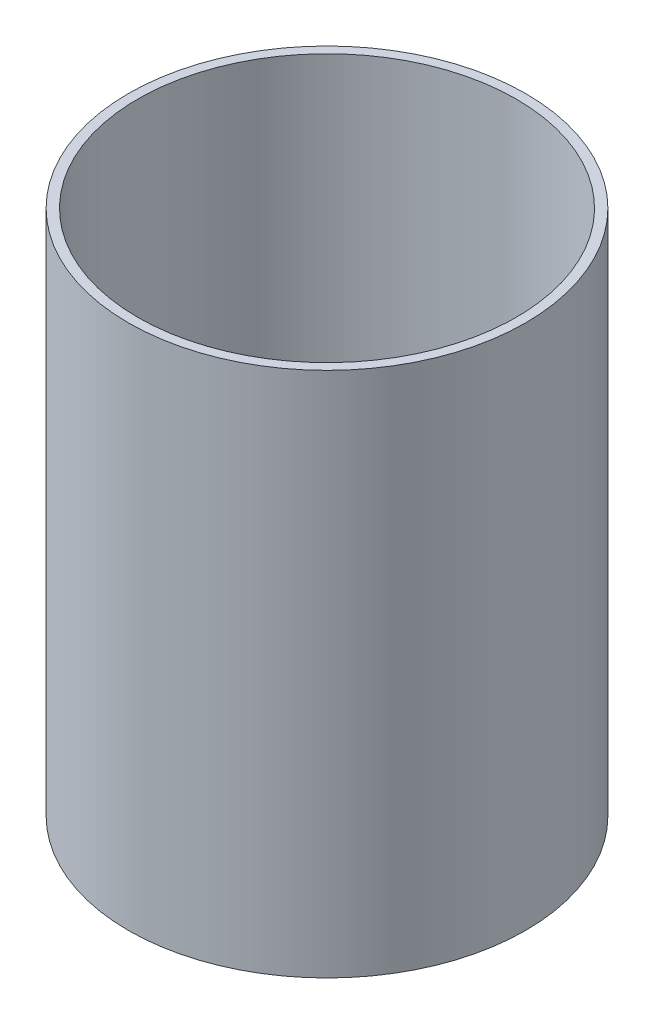
ISO-10303-21;
HEADER;
FILE_DESCRIPTION(('STEP AP214'),'2;1');
FILE_NAME('part.step','',(''),(''),'','','');
FILE_SCHEMA(('AUTOMOTIVE_DESIGN { 1 0 10303 214 1 1 1 1 }'));
ENDSEC;
DATA;
#1=APPLICATION_CONTEXT('core data for automotive mechanical design processes');
#2=APPLICATION_PROTOCOL_DEFINITION('international standard','automotive_design',2000,#1);
#3=PRODUCT_CONTEXT('',#1,'mechanical');
#4=PRODUCT('Part','Part','',(#3));
#5=PRODUCT_RELATED_PRODUCT_CATEGORY('part','',(#4));
#6=PRODUCT_DEFINITION_FORMATION('','',#4);
#7=PRODUCT_DEFINITION_CONTEXT('part definition',#1,'design');
#8=PRODUCT_DEFINITION('design','',#6,#7);
#9=PRODUCT_DEFINITION_SHAPE('','',#8);
#10=(LENGTH_UNIT() NAMED_UNIT(*) SI_UNIT(.MILLI.,.METRE.));
#11=(NAMED_UNIT(*) PLANE_ANGLE_UNIT() SI_UNIT($,.RADIAN.));
#12=(NAMED_UNIT(*) SI_UNIT($,.STERADIAN.) SOLID_ANGLE_UNIT());
#13=UNCERTAINTY_MEASURE_WITH_UNIT(LENGTH_MEASURE(1.E-05),#10,'distance_accuracy_value','');
#14=(GEOMETRIC_REPRESENTATION_CONTEXT(3) GLOBAL_UNCERTAINTY_ASSIGNED_CONTEXT((#13)) GLOBAL_UNIT_ASSIGNED_CONTEXT((#10,
#11,#12)) REPRESENTATION_CONTEXT('',''));
#15=CARTESIAN_POINT('',(0.,0.,0.));
#16=DIRECTION('',(0.,0.,1.));
#17=DIRECTION('',(1.,0.,0.));
#18=AXIS2_PLACEMENT_3D('',#15,#16,#17);
#19=CARTESIAN_POINT('',(0.,1669.,0.));
#20=DIRECTION('',(0.,-1.,0.));
#21=DIRECTION('',(0.,0.,-1.));
#22=AXIS2_PLACEMENT_3D('',#19,#20,#21);
#23=CYLINDRICAL_SURFACE('',#22,630.);
#24=CARTESIAN_POINT('',(0.,1669.,0.));
#25=DIRECTION('',(0.,1.,0.));
#26=DIRECTION('',(0.,0.,1.));
#27=AXIS2_PLACEMENT_3D('',#24,#25,#26);
#28=CIRCLE('',#27,630.);
#29=CARTESIAN_POINT('',(0.,1669.,630.));
#30=VERTEX_POINT('',#29);
#31=EDGE_CURVE('E10',#30,#30,#28,.T.);
#32=ORIENTED_EDGE('',*,*,#31,.F.);
#33=EDGE_LOOP('',(#32));
#34=FACE_BOUND('',#33,.T.);
#35=CARTESIAN_POINT('',(0.,0.,0.));
#36=DIRECTION('',(0.,1.,0.));
#37=DIRECTION('',(0.,0.,1.));
#38=AXIS2_PLACEMENT_3D('',#35,#36,#37);
#39=CIRCLE('',#38,630.);
#40=CARTESIAN_POINT('',(0.,0.,630.));
#41=VERTEX_POINT('',#40);
#42=EDGE_CURVE('E38',#41,#41,#39,.T.);
#43=ORIENTED_EDGE('',*,*,#42,.T.);
#44=EDGE_LOOP('',(#43));
#45=FACE_BOUND('',#44,.T.);
#46=ADVANCED_FACE('F31',(#34,#45),#23,.T.);
#47=CARTESIAN_POINT('',(0.,1669.,0.));
#48=DIRECTION('',(0.,1.,0.));
#49=DIRECTION('',(0.,0.,1.));
#50=AXIS2_PLACEMENT_3D('',#47,#48,#49);
#51=PLANE('',#50);
#52=CARTESIAN_POINT('',(0.,1669.,0.));
#53=DIRECTION('',(0.,1.,0.));
#54=DIRECTION('',(0.,0.,1.));
#55=AXIS2_PLACEMENT_3D('',#52,#53,#54);
#56=CIRCLE('',#55,600.);
#57=CARTESIAN_POINT('',(0.,1669.,600.));
#58=VERTEX_POINT('',#57);
#59=EDGE_CURVE('E44',#58,#58,#56,.T.);
#60=ORIENTED_EDGE('',*,*,#59,.F.);
#61=EDGE_LOOP('',(#60));
#62=FACE_BOUND('',#61,.T.);
#63=ORIENTED_EDGE('',*,*,#31,.T.);
#64=EDGE_LOOP('',(#63));
#65=FACE_BOUND('',#64,.T.);
#66=ADVANCED_FACE('F60',(#62,#65),#51,.T.);
#67=CARTESIAN_POINT('',(0.,0.,0.));
#68=DIRECTION('',(0.,1.,0.));
#69=DIRECTION('',(0.,0.,1.));
#70=AXIS2_PLACEMENT_3D('',#67,#68,#69);
#71=PLANE('',#70);
#72=CARTESIAN_POINT('',(0.,0.,0.));
#73=DIRECTION('',(0.,1.,0.));
#74=DIRECTION('',(0.,0.,1.));
#75=AXIS2_PLACEMENT_3D('',#72,#73,#74);
#76=CIRCLE('',#75,600.);
#77=CARTESIAN_POINT('',(0.,0.,600.));
#78=VERTEX_POINT('',#77);
#79=EDGE_CURVE('E34',#78,#78,#76,.T.);
#80=ORIENTED_EDGE('',*,*,#79,.T.);
#81=EDGE_LOOP('',(#80));
#82=FACE_BOUND('',#81,.T.);
#83=ORIENTED_EDGE('',*,*,#42,.F.);
#84=EDGE_LOOP('',(#83));
#85=FACE_BOUND('',#84,.T.);
#86=ADVANCED_FACE('F51',(#82,#85),#71,.F.);
#87=CARTESIAN_POINT('',(0.,-1245.,0.));
#88=DIRECTION('',(0.,1.,0.));
#89=DIRECTION('',(0.,0.,1.));
#90=AXIS2_PLACEMENT_3D('',#87,#88,#89);
#91=CYLINDRICAL_SURFACE('',#90,600.);
#92=ORIENTED_EDGE('',*,*,#59,.T.);
#93=EDGE_LOOP('',(#92));
#94=FACE_BOUND('',#93,.T.);
#95=ORIENTED_EDGE('',*,*,#79,.F.);
#96=EDGE_LOOP('',(#95));
#97=FACE_BOUND('',#96,.T.);
#98=ADVANCED_FACE('F54',(#94,#97),#91,.F.);
#99=CLOSED_SHELL('',(#46,#66,#86,#98));
#100=MANIFOLD_SOLID_BREP('B2',#99);
#101=ADVANCED_BREP_SHAPE_REPRESENTATION('',(#18,#100),#14);
#102=SHAPE_DEFINITION_REPRESENTATION(#9,#101);
ENDSEC;
END-ISO-10303-21;
